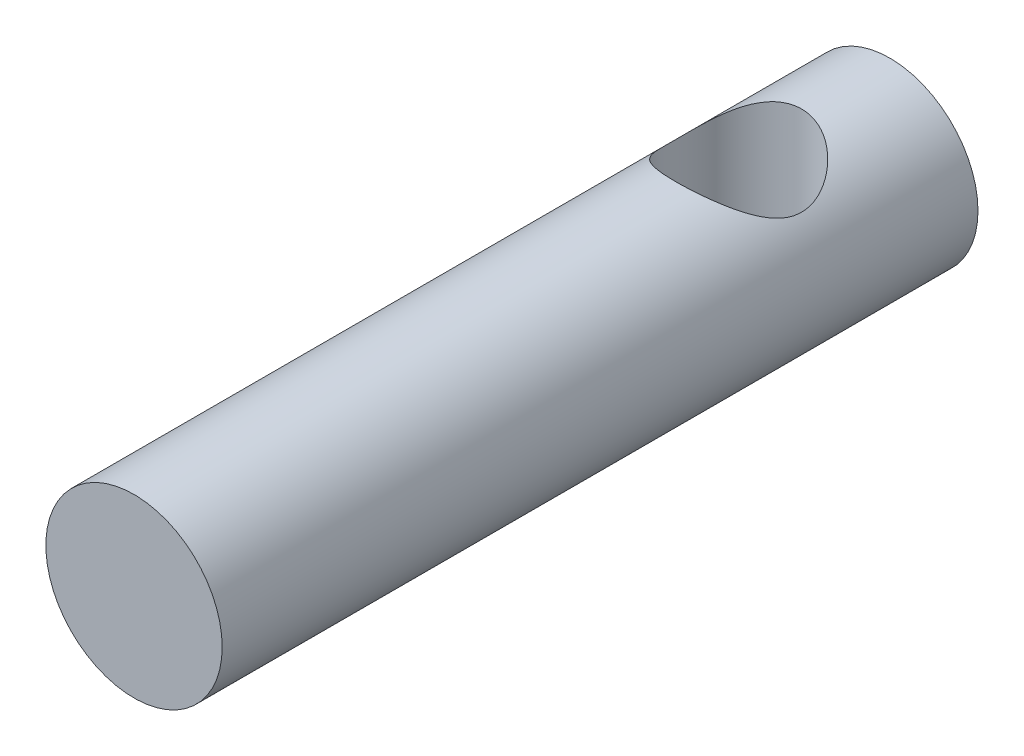
ISO-10303-21;
HEADER;
FILE_DESCRIPTION(('STEP AP214'),'2;1');
FILE_NAME('part.step','',(''),(''),'','','');
FILE_SCHEMA(('AUTOMOTIVE_DESIGN { 1 0 10303 214 1 1 1 1 }'));
ENDSEC;
DATA;
#1=APPLICATION_CONTEXT('core data for automotive mechanical design processes');
#2=APPLICATION_PROTOCOL_DEFINITION('international standard','automotive_design',2000,#1);
#3=PRODUCT_CONTEXT('',#1,'mechanical');
#4=PRODUCT('Part','Part','',(#3));
#5=PRODUCT_RELATED_PRODUCT_CATEGORY('part','',(#4));
#6=PRODUCT_DEFINITION_FORMATION('','',#4);
#7=PRODUCT_DEFINITION_CONTEXT('part definition',#1,'design');
#8=PRODUCT_DEFINITION('design','',#6,#7);
#9=PRODUCT_DEFINITION_SHAPE('','',#8);
#10=(LENGTH_UNIT() NAMED_UNIT(*) SI_UNIT(.MILLI.,.METRE.));
#11=(NAMED_UNIT(*) PLANE_ANGLE_UNIT() SI_UNIT($,.RADIAN.));
#12=(NAMED_UNIT(*) SI_UNIT($,.STERADIAN.) SOLID_ANGLE_UNIT());
#13=UNCERTAINTY_MEASURE_WITH_UNIT(LENGTH_MEASURE(1.E-05),#10,'distance_accuracy_value','');
#14=(GEOMETRIC_REPRESENTATION_CONTEXT(3) GLOBAL_UNCERTAINTY_ASSIGNED_CONTEXT((#13)) GLOBAL_UNIT_ASSIGNED_CONTEXT((#10,
#11,#12)) REPRESENTATION_CONTEXT('',''));
#15=CARTESIAN_POINT('',(0.,0.,0.));
#16=DIRECTION('',(0.,0.,1.));
#17=DIRECTION('',(1.,0.,0.));
#18=AXIS2_PLACEMENT_3D('',#15,#16,#17);
#19=CARTESIAN_POINT('',(0.65666714406075,0.613841025969831,15.));
#20=DIRECTION('',(0.,0.,-1.));
#21=DIRECTION('',(-1.,0.,0.));
#22=AXIS2_PLACEMENT_3D('',#19,#20,#21);
#23=CYLINDRICAL_SURFACE('',#22,1.75);
#24=CARTESIAN_POINT('',(0.65666714406075,-1.13615897403017,4.25));
#25=CARTESIAN_POINT('',(0.718533800022678,-1.13616023544377,4.2500013893205));
#26=CARTESIAN_POINT('',(0.780394050562384,-1.132851112132,4.2453813510172));
#27=CARTESIAN_POINT('',(0.902115069535003,-1.11994237052567,4.22721039574681));
#28=CARTESIAN_POINT('',(0.961974956083126,-1.11034001525311,4.21365559296286));
#29=CARTESIAN_POINT('',(1.07773444398761,-1.08577395933377,4.17849390936082));
#30=CARTESIAN_POINT('',(1.13365222171838,-1.07083709693322,4.15692731493233));
#31=CARTESIAN_POINT('',(1.24078409942059,-1.03675632351537,4.1067118958717));
#32=CARTESIAN_POINT('',(1.29199756806139,-1.01761184899168,4.07806212255732));
#33=CARTESIAN_POINT('',(1.39346585614298,-0.974532791363239,4.01174387358421));
#34=CARTESIAN_POINT('',(1.44322322119055,-0.950322654555347,3.97349717029566));
#35=CARTESIAN_POINT('',(1.53605949737477,-0.900081686725892,3.89053497613778));
#36=CARTESIAN_POINT('',(1.57912820265444,-0.874048159625725,3.8458097972186));
#37=CARTESIAN_POINT('',(1.66550162658909,-0.817202950890389,3.74171344881114));
#38=CARTESIAN_POINT('',(1.70739303062421,-0.786393051568673,3.68116147128851));
#39=CARTESIAN_POINT('',(1.78046609220055,-0.728449601425023,3.55230591507957));
#40=CARTESIAN_POINT('',(1.81166481951867,-0.701310233305184,3.48401492509123));
#41=CARTESIAN_POINT('',(1.85376828173357,-0.662868666802717,3.36347040287421));
#42=CARTESIAN_POINT('',(1.86797266487277,-0.64927935488957,3.31310824990621));
#43=CARTESIAN_POINT('',(1.89004406201578,-0.627739724463534,3.20989061678107));
#44=CARTESIAN_POINT('',(1.8979245162713,-0.619777451124808,3.15704067853022));
#45=CARTESIAN_POINT('',(1.90683841893637,-0.610747845813314,3.04980068195636));
#46=CARTESIAN_POINT('',(1.90782739302362,-0.609725300633,2.99540289061315));
#47=CARTESIAN_POINT('',(1.90275212769383,-0.614890802755972,2.88726741460671));
#48=CARTESIAN_POINT('',(1.89668206192786,-0.621084806419872,2.83353031227612));
#49=CARTESIAN_POINT('',(1.87676661407487,-0.640779006247729,2.72162713817785));
#50=CARTESIAN_POINT('',(1.86202608014153,-0.655112327060295,2.66377363308106));
#51=CARTESIAN_POINT('',(1.82516025953941,-0.68913610753706,2.5521176356939));
#52=CARTESIAN_POINT('',(1.80301860747997,-0.708838421149066,2.49832444760981));
#53=CARTESIAN_POINT('',(1.74426500087105,-0.757838875020091,2.37927200023512));
#54=CARTESIAN_POINT('',(1.7052951237138,-0.788218534650142,2.31562606712785));
#55=CARTESIAN_POINT('',(1.61707112533071,-0.850070557394751,2.19649269232609));
#56=CARTESIAN_POINT('',(1.5678068955073,-0.881543969009225,2.14101336182787));
#57=CARTESIAN_POINT('',(1.45900117266741,-0.942659961082027,2.03854491453048));
#58=CARTESIAN_POINT('',(1.39936328603993,-0.972281469415578,1.99164474967756));
#59=CARTESIAN_POINT('',(1.27093600026124,-1.02627982145321,1.90867762775615));
#60=CARTESIAN_POINT('',(1.20216807379185,-1.05066863010075,1.87258587996395));
#61=CARTESIAN_POINT('',(1.07565611280412,-1.08618857952912,1.82086740490431));
#62=CARTESIAN_POINT('',(1.01958625520471,-1.09911499934912,1.80236780974965));
#63=CARTESIAN_POINT('',(0.904456817316668,-1.11951036320016,1.77337255223889));
#64=CARTESIAN_POINT('',(0.845399442962912,-1.12698327289268,1.76287107360173));
#65=CARTESIAN_POINT('',(0.725734488275517,-1.13582738732107,1.75045657667307));
#66=CARTESIAN_POINT('',(0.66512259887551,-1.13717923532271,1.74857080380042));
#67=CARTESIAN_POINT('',(0.544448690304428,-1.13360026607416,1.75358347635995));
#68=CARTESIAN_POINT('',(0.484386730228727,-1.12866878141612,1.76048285494006));
#69=CARTESIAN_POINT('',(0.369456325351009,-1.11335740348314,1.78210478653568));
#70=CARTESIAN_POINT('',(0.314476774208828,-1.10324824156814,1.79643901810855));
#71=CARTESIAN_POINT('',(0.207883205750707,-1.07852122326305,1.83198773927784));
#72=CARTESIAN_POINT('',(0.156269873529727,-1.06390245252192,1.85320362421694));
#73=CARTESIAN_POINT('',(0.0527255416756503,-1.02962886112791,1.90392744115693));
#74=CARTESIAN_POINT('',(0.00119156717728585,-1.00963720532771,1.93401353834905));
#75=CARTESIAN_POINT('',(-0.0963125766634801,-0.966780254692579,2.00049531366194));
#76=CARTESIAN_POINT('',(-0.142278385179486,-0.943912735766851,2.03689588352823));
#77=CARTESIAN_POINT('',(-0.236090804193321,-0.892424962790486,2.1223837708317));
#78=CARTESIAN_POINT('',(-0.282772027602306,-0.863512613875921,2.17257487295396));
#79=CARTESIAN_POINT('',(-0.367483382511742,-0.806099847081173,2.28006754060672));
#80=CARTESIAN_POINT('',(-0.405508899736311,-0.777599656464183,2.33737287363032));
#81=CARTESIAN_POINT('',(-0.467004988289238,-0.728234543775708,2.44929144940153));
#82=CARTESIAN_POINT('',(-0.491818403788247,-0.706871042427448,2.50294307251035));
#83=CARTESIAN_POINT('',(-0.533959750548144,-0.669012338967338,2.61470039916742));
#84=CARTESIAN_POINT('',(-0.551303516885553,-0.652506861990451,2.67279636984633));
#85=CARTESIAN_POINT('',(-0.575068134804169,-0.629361819427982,2.78134107191197));
#86=CARTESIAN_POINT('',(-0.582921775516772,-0.621457257999252,2.8311986963037));
#87=CARTESIAN_POINT('',(-0.592510186096758,-0.611763480772686,2.93206818673486));
#88=CARTESIAN_POINT('',(-0.594251776988734,-0.609967447949095,2.9830787021));
#89=CARTESIAN_POINT('',(-0.591493730416641,-0.612779069850222,3.0847458935697));
#90=CARTESIAN_POINT('',(-0.586993670349851,-0.617387158178054,3.13540254548187));
#91=CARTESIAN_POINT('',(-0.572079121504611,-0.63226871958823,3.23500703211449));
#92=CARTESIAN_POINT('',(-0.561655482973438,-0.642550956433037,3.28395209861605));
#93=CARTESIAN_POINT('',(-0.531007977911614,-0.671657911330842,3.39535351157921));
#94=CARTESIAN_POINT('',(-0.508660217198954,-0.692196604814942,3.45676887592431));
#95=CARTESIAN_POINT('',(-0.455582838116843,-0.7376844072896,3.5740761639279));
#96=CARTESIAN_POINT('',(-0.424839286787914,-0.762640823130359,3.62995869382595));
#97=CARTESIAN_POINT('',(-0.354796319651347,-0.814936193449521,3.73733049006712));
#98=CARTESIAN_POINT('',(-0.315289003032417,-0.842321178661158,3.78866114646921));
#99=CARTESIAN_POINT('',(-0.228668111017071,-0.896555154105524,3.88479893605189));
#100=CARTESIAN_POINT('',(-0.181551922002229,-0.923403956587929,3.92960381755997));
#101=CARTESIAN_POINT('',(-0.0713354695456504,-0.978936926006727,4.01900443777824));
#102=CARTESIAN_POINT('',(-0.00687968612986798,-1.0071481653961,4.06225070330783));
#103=CARTESIAN_POINT('',(0.130937396835278,-1.0569202779733,4.13675391880873));
#104=CARTESIAN_POINT('',(0.204283181236364,-1.07849251133851,4.16803137151089));
#105=CARTESIAN_POINT('',(0.3407658832204,-1.10850369899183,4.21105335876851));
#106=CARTESIAN_POINT('',(0.402623520871133,-1.11878375847643,4.22557478096837));
#107=CARTESIAN_POINT('',(0.528546919053662,-1.13260745975756,4.24504271565745));
#108=CARTESIAN_POINT('',(0.59261046502771,-1.13615766796368,4.24999856149882));
#109=CARTESIAN_POINT('',(0.65666714406075,-1.13615897403017,4.25));
#110=B_SPLINE_CURVE_WITH_KNOTS('',3,(#24,#25,#26,#27,#28,#29,#30,#31,#32,#33,#34,#35,#36,#37,
#38,#39,#40,#41,#42,#43,#44,#45,#46,#47,#48,#49,#50,#51,#52,#53,#54,#55,#56,#57,#58,#59,#60,#61,
#62,#63,#64,#65,#66,#67,#68,#69,#70,#71,#72,#73,#74,#75,#76,#77,#78,#79,#80,#81,#82,#83,#84,#85,
#86,#87,#88,#89,#90,#91,#92,#93,#94,#95,#96,#97,#98,#99,#100,#101,#102,#103,#104,#105,#106,#107,
#108,#109),.UNSPECIFIED.,.T.,.F.,(4,2,2,2,2,2,2,2,2,2,2,2,2,2,2,2,2,2,2,2,2,2,2,2,2,2,2,2,2,2,2,
2,2,2,2,2,2,2,2,2,2,2,4),(0.,0.185339280861186,0.370759220827253,0.55525914692341,
0.739783797330038,0.940849309796006,1.14221866496416,1.38062201102653,1.61864297790605,
1.78023669503148,1.94148606051598,2.10377509659121,2.26619817696492,2.44939479118706,
2.63299920036008,2.87350656828858,3.11425122302132,3.35736572027281,3.59991825027982,
3.78048258139405,3.96091547927491,4.14191856639026,4.3229408810337,4.49534000144005,
4.66777409983298,4.85587161107898,5.04411549529222,5.26643058372294,5.48886391013174,
5.67678861003719,5.86431293939486,6.0169093809279,6.1693354711577,6.32177188218651,
6.47444439396745,6.67884563668494,6.8835881700035,7.09383811128633,7.30416042683316,
7.55049617022494,7.79640802790287,7.98849566914452,8.18039579113666),.UNSPECIFIED.);
#111=CARTESIAN_POINT('',(0.65666714406075,-1.13615897403017,4.25));
#112=VERTEX_POINT('',#111);
#113=EDGE_CURVE('E10',#112,#112,#110,.T.);
#114=ORIENTED_EDGE('',*,*,#113,.T.);
#115=EDGE_LOOP('',(#114));
#116=FACE_BOUND('',#115,.T.);
#117=CARTESIAN_POINT('',(0.65666714406075,2.36384102596983,4.25));
#118=CARTESIAN_POINT('',(0.594800488098823,2.36384228738343,4.2500013893205));
#119=CARTESIAN_POINT('',(0.532940237559117,2.36053316407166,4.2453813510172));
#120=CARTESIAN_POINT('',(0.411219218586498,2.34762442246534,4.22721039574681));
#121=CARTESIAN_POINT('',(0.351359332038375,2.33802206719277,4.21365559296286));
#122=CARTESIAN_POINT('',(0.235599844133892,2.31345601127344,4.17849390936082));
#123=CARTESIAN_POINT('',(0.179682066403124,2.29851914887288,4.15692731493233));
#124=CARTESIAN_POINT('',(0.0725501887009075,2.26443837545503,4.1067118958717));
#125=CARTESIAN_POINT('',(0.021336720060107,2.24529390093134,4.07806212255732));
#126=CARTESIAN_POINT('',(-0.0801315680214788,2.2022148433029,4.01174387358421));
#127=CARTESIAN_POINT('',(-0.129888933069046,2.17800470649501,3.97349717029566));
#128=CARTESIAN_POINT('',(-0.222725209253267,2.12776373866555,3.89053497613778));
#129=CARTESIAN_POINT('',(-0.265793914532944,2.10173021156539,3.8458097972186));
#130=CARTESIAN_POINT('',(-0.352167338467591,2.04488500283005,3.74171344881114));
#131=CARTESIAN_POINT('',(-0.394058742502705,2.01407510350834,3.68116147128851));
#132=CARTESIAN_POINT('',(-0.46713180407905,1.95613165336469,3.55230591507957));
#133=CARTESIAN_POINT('',(-0.498330531397171,1.92899228524485,3.48401492509123));
#134=CARTESIAN_POINT('',(-0.540433993612069,1.89055071874238,3.36347040287421));
#135=CARTESIAN_POINT('',(-0.554638376751271,1.87696140682923,3.31310824990621));
#136=CARTESIAN_POINT('',(-0.576709773894281,1.8554217764032,3.20989061678107));
#137=CARTESIAN_POINT('',(-0.5845902281498,1.84745950306447,3.15704067853022));
#138=CARTESIAN_POINT('',(-0.59350413081487,1.83842989775298,3.04980068195636));
#139=CARTESIAN_POINT('',(-0.594493104902119,1.83740735257266,2.99540289061315));
#140=CARTESIAN_POINT('',(-0.589417839572328,1.84257285469564,2.88726741460671));
#141=CARTESIAN_POINT('',(-0.583347773806362,1.84876685835953,2.83353031227612));
#142=CARTESIAN_POINT('',(-0.563432325953366,1.86846105818739,2.72162713817785));
#143=CARTESIAN_POINT('',(-0.548691792020028,1.88279437899996,2.66377363308106));
#144=CARTESIAN_POINT('',(-0.511825971417913,1.91681815947672,2.5521176356939));
#145=CARTESIAN_POINT('',(-0.489684319358474,1.93652047308873,2.49832444760981));
#146=CARTESIAN_POINT('',(-0.430930712749547,1.98552092695975,2.37927200023512));
#147=CARTESIAN_POINT('',(-0.391960835592301,2.0159005865898,2.31562606712785));
#148=CARTESIAN_POINT('',(-0.303736837209213,2.07775260933441,2.19649269232609));
#149=CARTESIAN_POINT('',(-0.254472607385797,2.10922602094889,2.14101336182787));
#150=CARTESIAN_POINT('',(-0.145666884545905,2.17034201302169,2.03854491453048));
#151=CARTESIAN_POINT('',(-0.0860289979184334,2.19996352135524,1.99164474967756));
#152=CARTESIAN_POINT('',(0.0423982878602577,2.25396187339287,1.90867762775615));
#153=CARTESIAN_POINT('',(0.111166214329651,2.27835068204041,1.87258587996395));
#154=CARTESIAN_POINT('',(0.237678175317376,2.31387063146878,1.82086740490431));
#155=CARTESIAN_POINT('',(0.293748032916787,2.32679705128878,1.80236780974965));
#156=CARTESIAN_POINT('',(0.408877470804832,2.34719241513982,1.77337255223889));
#157=CARTESIAN_POINT('',(0.467934845158589,2.35466532483234,1.76287107360173));
#158=CARTESIAN_POINT('',(0.587599799845984,2.36350943926073,1.75045657667307));
#159=CARTESIAN_POINT('',(0.648211689245991,2.36486128726237,1.74857080380042));
#160=CARTESIAN_POINT('',(0.768885597817073,2.36128231801382,1.75358347635995));
#161=CARTESIAN_POINT('',(0.828947557892774,2.35635083335578,1.76048285494006));
#162=CARTESIAN_POINT('',(0.943877962770491,2.34103945542281,1.78210478653568));
#163=CARTESIAN_POINT('',(0.998857513912672,2.3309302935078,1.79643901810855));
#164=CARTESIAN_POINT('',(1.10545108237079,2.30620327520271,1.83198773927784));
#165=CARTESIAN_POINT('',(1.15706441459177,2.29158450446159,1.85320362421694));
#166=CARTESIAN_POINT('',(1.26060874644585,2.25731091306757,1.90392744115693));
#167=CARTESIAN_POINT('',(1.31214272094421,2.23731925726737,1.93401353834905));
#168=CARTESIAN_POINT('',(1.40964686478498,2.19446230663224,2.00049531366194));
#169=CARTESIAN_POINT('',(1.45561267330099,2.17159478770651,2.03689588352823));
#170=CARTESIAN_POINT('',(1.54942509231482,2.12010701473015,2.1223837708317));
#171=CARTESIAN_POINT('',(1.59610631572381,2.09119466581558,2.17257487295396));
#172=CARTESIAN_POINT('',(1.68081767063324,2.03378189902083,2.28006754060672));
#173=CARTESIAN_POINT('',(1.71884318785781,2.00528170840384,2.33737287363032));
#174=CARTESIAN_POINT('',(1.78033927641074,1.95591659571537,2.44929144940153));
#175=CARTESIAN_POINT('',(1.80515269190975,1.93455309436711,2.50294307251035));
#176=CARTESIAN_POINT('',(1.84729403866965,1.896694390907,2.61470039916742));
#177=CARTESIAN_POINT('',(1.86463780500705,1.88018891393011,2.67279636984633));
#178=CARTESIAN_POINT('',(1.88840242292567,1.85704387136764,2.78134107191197));
#179=CARTESIAN_POINT('',(1.89625606363827,1.84913930993891,2.8311986963037));
#180=CARTESIAN_POINT('',(1.90584447421826,1.83944553271235,2.93206818673486));
#181=CARTESIAN_POINT('',(1.90758606511023,1.83764949988876,2.9830787021));
#182=CARTESIAN_POINT('',(1.90482801853814,1.84046112178988,3.0847458935697));
#183=CARTESIAN_POINT('',(1.90032795847135,1.84506921011772,3.13540254548187));
#184=CARTESIAN_POINT('',(1.88541340962611,1.85995077152789,3.23500703211449));
#185=CARTESIAN_POINT('',(1.87498977109494,1.8702330083727,3.28395209861605));
#186=CARTESIAN_POINT('',(1.84434226603312,1.8993399632705,3.3953535115792));
#187=CARTESIAN_POINT('',(1.82199450532045,1.9198786567546,3.45676887592431));
#188=CARTESIAN_POINT('',(1.76891712623834,1.96536645922926,3.5740761639279));
#189=CARTESIAN_POINT('',(1.73817357490941,1.99032287507002,3.62995869382595));
#190=CARTESIAN_POINT('',(1.66813060777285,2.04261824538918,3.73733049006712));
#191=CARTESIAN_POINT('',(1.62862329115392,2.07000323060082,3.78866114646921));
#192=CARTESIAN_POINT('',(1.54200239913857,2.12423720604518,3.88479893605189));
#193=CARTESIAN_POINT('',(1.49488621012373,2.15108600852759,3.92960381755997));
#194=CARTESIAN_POINT('',(1.38466975766715,2.20661897794639,4.01900443777824));
#195=CARTESIAN_POINT('',(1.32021397425137,2.23483021733576,4.06225070330783));
#196=CARTESIAN_POINT('',(1.18239689128622,2.28460232991297,4.13675391880873));
#197=CARTESIAN_POINT('',(1.10905110688514,2.30617456327817,4.16803137151089));
#198=CARTESIAN_POINT('',(0.972568404901101,2.33618575093149,4.21105335876851));
#199=CARTESIAN_POINT('',(0.910710767250368,2.34646581041609,4.22557478096837));
#200=CARTESIAN_POINT('',(0.784787369067839,2.36028951169723,4.24504271565745));
#201=CARTESIAN_POINT('',(0.72072382309379,2.36383971990334,4.24999856149882));
#202=CARTESIAN_POINT('',(0.65666714406075,2.36384102596983,4.25));
#203=B_SPLINE_CURVE_WITH_KNOTS('',3,(#117,#118,#119,#120,#121,#122,#123,#124,#125,#126,#127,
#128,#129,#130,#131,#132,#133,#134,#135,#136,#137,#138,#139,#140,#141,#142,#143,#144,#145,#146,
#147,#148,#149,#150,#151,#152,#153,#154,#155,#156,#157,#158,#159,#160,#161,#162,#163,#164,#165,
#166,#167,#168,#169,#170,#171,#172,#173,#174,#175,#176,#177,#178,#179,#180,#181,#182,#183,#184,
#185,#186,#187,#188,#189,#190,#191,#192,#193,#194,#195,#196,#197,#198,#199,#200,#201,#202),
.UNSPECIFIED.,.T.,.F.,(4,2,2,2,2,2,2,2,2,2,2,2,2,2,2,2,2,2,2,2,2,2,2,2,2,2,2,2,2,2,2,2,2,2,2,2,
2,2,2,2,2,2,4),(0.,0.185339280861186,0.370759220827252,0.55525914692341,0.739783797330038,
0.940849309796006,1.14221866496416,1.38062201102652,1.61864297790605,1.78023669503148,
1.94148606051598,2.10377509659121,2.26619817696491,2.44939479118705,2.63299920036008,
2.87350656828858,3.11425122302132,3.35736572027281,3.59991825027982,3.78048258139405,
3.96091547927491,4.14191856639026,4.3229408810337,4.49534000144005,4.66777409983298,
4.85587161107898,5.04411549529222,5.26643058372294,5.48886391013174,5.67678861003719,
5.86431293939486,6.0169093809279,6.1693354711577,6.32177188218651,6.47444439396744,
6.67884563668494,6.8835881700035,7.09383811128632,7.30416042683316,7.55049617022494,
7.79640802790287,7.98849566914452,8.18039579113665),.UNSPECIFIED.);
#204=CARTESIAN_POINT('',(0.65666714406075,2.36384102596983,4.25));
#205=VERTEX_POINT('',#204);
#206=EDGE_CURVE('E55',#205,#205,#203,.T.);
#207=ORIENTED_EDGE('',*,*,#206,.T.);
#208=EDGE_LOOP('',(#207));
#209=FACE_BOUND('',#208,.T.);
#210=CARTESIAN_POINT('',(0.65666714406075,0.613841025969831,15.));
#211=DIRECTION('',(0.,0.,1.));
#212=DIRECTION('',(1.,0.,0.));
#213=AXIS2_PLACEMENT_3D('',#210,#211,#212);
#214=CIRCLE('',#213,1.75);
#215=CARTESIAN_POINT('',(2.40666714406075,0.613841025969831,15.));
#216=VERTEX_POINT('',#215);
#217=EDGE_CURVE('E60',#216,#216,#214,.T.);
#218=ORIENTED_EDGE('',*,*,#217,.F.);
#219=EDGE_LOOP('',(#218));
#220=FACE_BOUND('',#219,.T.);
#221=CARTESIAN_POINT('',(0.65666714406075,0.613841025969831,0.));
#222=DIRECTION('',(0.,0.,1.));
#223=DIRECTION('',(1.,0.,0.));
#224=AXIS2_PLACEMENT_3D('',#221,#222,#223);
#225=CIRCLE('',#224,1.75);
#226=CARTESIAN_POINT('',(2.40666714406075,0.613841025969831,0.));
#227=VERTEX_POINT('',#226);
#228=EDGE_CURVE('E65',#227,#227,#225,.T.);
#229=ORIENTED_EDGE('',*,*,#228,.T.);
#230=EDGE_LOOP('',(#229));
#231=FACE_BOUND('',#230,.T.);
#232=ADVANCED_FACE('F43',(#116,#209,#220,#231),#23,.T.);
#233=CARTESIAN_POINT('',(0.65666714406075,0.613841025969831,15.));
#234=DIRECTION('',(0.,0.,1.));
#235=DIRECTION('',(1.,0.,0.));
#236=AXIS2_PLACEMENT_3D('',#233,#234,#235);
#237=PLANE('',#236);
#238=ORIENTED_EDGE('',*,*,#217,.T.);
#239=EDGE_LOOP('',(#238));
#240=FACE_BOUND('',#239,.T.);
#241=ADVANCED_FACE('F77',(#240),#237,.T.);
#242=CARTESIAN_POINT('',(0.65666714406075,0.613841025969831,0.));
#243=DIRECTION('',(0.,0.,1.));
#244=DIRECTION('',(1.,0.,0.));
#245=AXIS2_PLACEMENT_3D('',#242,#243,#244);
#246=PLANE('',#245);
#247=ORIENTED_EDGE('',*,*,#228,.F.);
#248=EDGE_LOOP('',(#247));
#249=FACE_BOUND('',#248,.T.);
#250=ADVANCED_FACE('F75',(#249),#246,.F.);
#251=CARTESIAN_POINT('',(0.65666714406075,-1.13615897403017,3.));
#252=DIRECTION('',(0.,1.,0.));
#253=DIRECTION('',(0.,0.,1.));
#254=AXIS2_PLACEMENT_3D('',#251,#252,#253);
#255=CYLINDRICAL_SURFACE('',#254,1.25);
#256=ORIENTED_EDGE('',*,*,#206,.F.);
#257=EDGE_LOOP('',(#256));
#258=FACE_BOUND('',#257,.T.);
#259=ORIENTED_EDGE('',*,*,#113,.F.);
#260=EDGE_LOOP('',(#259));
#261=FACE_BOUND('',#260,.T.);
#262=ADVANCED_FACE('F71',(#258,#261),#255,.F.);
#263=CLOSED_SHELL('',(#232,#241,#250,#262));
#264=MANIFOLD_SOLID_BREP('B2',#263);
#265=ADVANCED_BREP_SHAPE_REPRESENTATION('',(#18,#264),#14);
#266=SHAPE_DEFINITION_REPRESENTATION(#9,#265);
ENDSEC;
END-ISO-10303-21;
